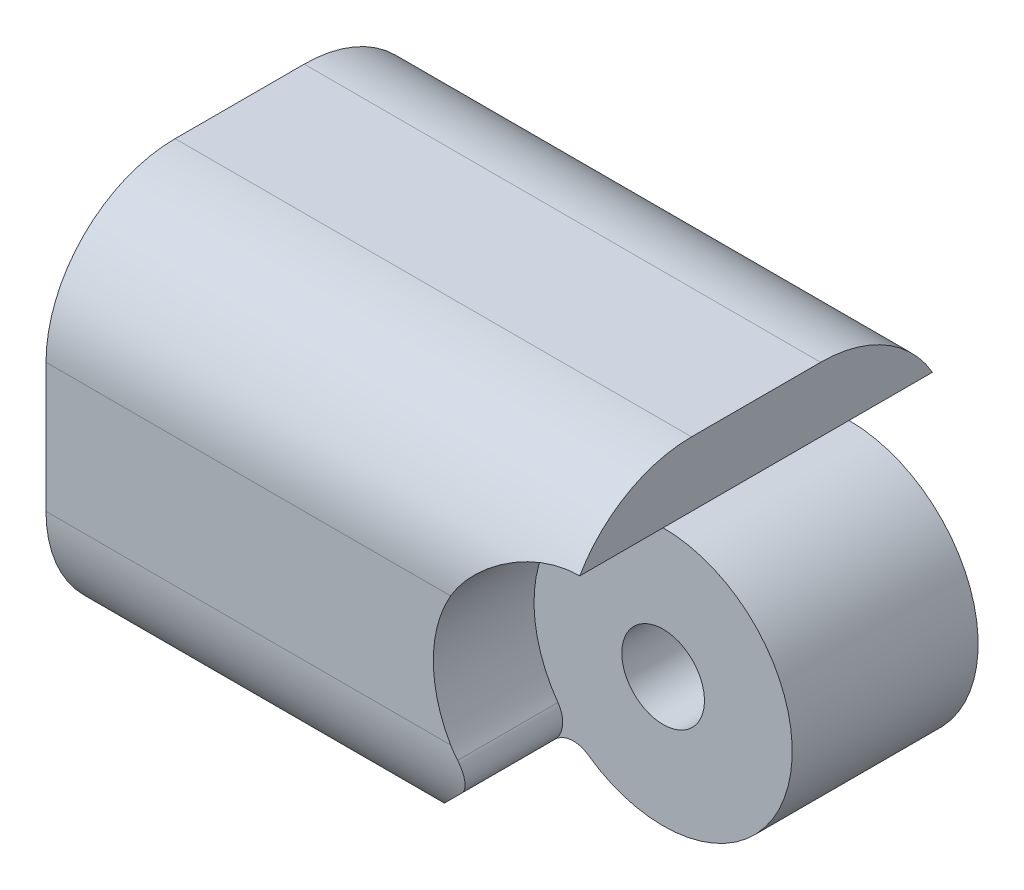
ISO-10303-21;
HEADER;
FILE_DESCRIPTION(('STEP AP214'),'2;1');
FILE_NAME('part.step','',(''),(''),'','','');
FILE_SCHEMA(('AUTOMOTIVE_DESIGN { 1 0 10303 214 1 1 1 1 }'));
ENDSEC;
DATA;
#1=APPLICATION_CONTEXT('core data for automotive mechanical design processes');
#2=APPLICATION_PROTOCOL_DEFINITION('international standard','automotive_design',2000,#1);
#3=PRODUCT_CONTEXT('',#1,'mechanical');
#4=PRODUCT('Part','Part','',(#3));
#5=PRODUCT_RELATED_PRODUCT_CATEGORY('part','',(#4));
#6=PRODUCT_DEFINITION_FORMATION('','',#4);
#7=PRODUCT_DEFINITION_CONTEXT('part definition',#1,'design');
#8=PRODUCT_DEFINITION('design','',#6,#7);
#9=PRODUCT_DEFINITION_SHAPE('','',#8);
#10=(LENGTH_UNIT() NAMED_UNIT(*) SI_UNIT(.MILLI.,.METRE.));
#11=(NAMED_UNIT(*) PLANE_ANGLE_UNIT() SI_UNIT($,.RADIAN.));
#12=(NAMED_UNIT(*) SI_UNIT($,.STERADIAN.) SOLID_ANGLE_UNIT());
#13=UNCERTAINTY_MEASURE_WITH_UNIT(LENGTH_MEASURE(1.E-05),#10,'distance_accuracy_value','');
#14=(GEOMETRIC_REPRESENTATION_CONTEXT(3) GLOBAL_UNCERTAINTY_ASSIGNED_CONTEXT((#13)) GLOBAL_UNIT_ASSIGNED_CONTEXT((#10,
#11,#12)) REPRESENTATION_CONTEXT('',''));
#15=CARTESIAN_POINT('',(0.,0.,0.));
#16=DIRECTION('',(0.,0.,1.));
#17=DIRECTION('',(1.,0.,0.));
#18=AXIS2_PLACEMENT_3D('',#15,#16,#17);
#19=CARTESIAN_POINT('',(10.,0.,7.5));
#20=DIRECTION('',(0.,0.,-1.));
#21=DIRECTION('',(-1.,0.,0.));
#22=AXIS2_PLACEMENT_3D('',#19,#20,#21);
#23=CYLINDRICAL_SURFACE('',#22,5.);
#24=CARTESIAN_POINT('',(10.,0.,11.1));
#25=DIRECTION('',(0.,0.,-1.));
#26=DIRECTION('',(-1.,0.,0.));
#27=AXIS2_PLACEMENT_3D('',#24,#25,#26);
#28=CIRCLE('',#27,5.);
#29=CARTESIAN_POINT('',(10.,5.,11.1));
#30=VERTEX_POINT('',#29);
#31=CARTESIAN_POINT('',(7.10317220709676,-4.07533909488074,11.1));
#32=VERTEX_POINT('',#31);
#33=EDGE_CURVE('E328',#30,#32,#28,.T.);
#34=ORIENTED_EDGE('',*,*,#33,.T.);
#35=DIRECTION('',(0.,0.,-1.));
#36=VECTOR('',#35,1.);
#37=CARTESIAN_POINT('',(7.10317220709676,-4.07533909488073,7.5));
#38=LINE('',#37,#36);
#39=CARTESIAN_POINT('',(7.10317220709676,-4.07533909488074,3.9));
#40=VERTEX_POINT('',#39);
#41=EDGE_CURVE('E315',#32,#40,#38,.T.);
#42=ORIENTED_EDGE('',*,*,#41,.T.);
#43=CARTESIAN_POINT('',(10.,0.,3.9));
#44=DIRECTION('',(0.,0.,-1.));
#45=DIRECTION('',(-1.,0.,0.));
#46=AXIS2_PLACEMENT_3D('',#43,#44,#45);
#47=CIRCLE('',#46,5.);
#48=CARTESIAN_POINT('',(10.,5.,3.9));
#49=VERTEX_POINT('',#48);
#50=EDGE_CURVE('E257',#49,#40,#47,.T.);
#51=ORIENTED_EDGE('',*,*,#50,.F.);
#52=DIRECTION('',(0.,0.,-1.));
#53=VECTOR('',#52,1.);
#54=CARTESIAN_POINT('',(10.,5.,7.5));
#55=LINE('',#54,#53);
#56=EDGE_CURVE('E330',#30,#49,#55,.T.);
#57=ORIENTED_EDGE('',*,*,#56,.F.);
#58=EDGE_LOOP('',(#34,#42,#51,#57));
#59=FACE_BOUND('',#58,.T.);
#60=ADVANCED_FACE('F33',(#59),#23,.T.);
#61=CARTESIAN_POINT('',(10.,0.,7.5));
#62=DIRECTION('',(0.,0.,-1.));
#63=DIRECTION('',(-1.,0.,0.));
#64=AXIS2_PLACEMENT_3D('',#61,#62,#63);
#65=CYLINDRICAL_SURFACE('',#64,1.6);
#66=CARTESIAN_POINT('',(10.,0.,3.9));
#67=DIRECTION('',(0.,0.,-1.));
#68=DIRECTION('',(-1.,0.,0.));
#69=AXIS2_PLACEMENT_3D('',#66,#67,#68);
#70=CIRCLE('',#69,1.6);
#71=CARTESIAN_POINT('',(8.4,0.,3.9));
#72=VERTEX_POINT('',#71);
#73=EDGE_CURVE('E294',#72,#72,#70,.T.);
#74=ORIENTED_EDGE('',*,*,#73,.T.);
#75=EDGE_LOOP('',(#74));
#76=FACE_BOUND('',#75,.T.);
#77=CARTESIAN_POINT('',(10.,0.,11.1));
#78=DIRECTION('',(0.,0.,-1.));
#79=DIRECTION('',(-1.,0.,0.));
#80=AXIS2_PLACEMENT_3D('',#77,#78,#79);
#81=CIRCLE('',#80,1.6);
#82=CARTESIAN_POINT('',(8.4,0.,11.1));
#83=VERTEX_POINT('',#82);
#84=EDGE_CURVE('E223',#83,#83,#81,.T.);
#85=ORIENTED_EDGE('',*,*,#84,.F.);
#86=EDGE_LOOP('',(#85));
#87=FACE_BOUND('',#86,.T.);
#88=ADVANCED_FACE('F441',(#76,#87),#65,.F.);
#89=CARTESIAN_POINT('',(10.,0.,0.));
#90=DIRECTION('',(0.,0.,1.));
#91=DIRECTION('',(1.,0.,0.));
#92=AXIS2_PLACEMENT_3D('',#89,#90,#91);
#93=PLANE('',#92);
#94=DIRECTION('',(-1.,0.,0.));
#95=VECTOR('',#94,1.);
#96=CARTESIAN_POINT('',(10.,2.5,0.));
#97=LINE('',#96,#95);
#98=CARTESIAN_POINT('',(-10.,2.5,0.));
#99=VERTEX_POINT('',#98);
#100=CARTESIAN_POINT('',(5.6698729810778,2.5,0.));
#101=VERTEX_POINT('',#100);
#102=EDGE_CURVE('E388',#99,#101,#97,.F.);
#103=ORIENTED_EDGE('',*,*,#102,.T.);
#104=CARTESIAN_POINT('',(10.,0.,0.));
#105=DIRECTION('',(0.,0.,-1.));
#106=DIRECTION('',(-1.,0.,0.));
#107=AXIS2_PLACEMENT_3D('',#104,#105,#106);
#108=CIRCLE('',#107,5.);
#109=CARTESIAN_POINT('',(5.6698729810778,-2.5,0.));
#110=VERTEX_POINT('',#109);
#111=EDGE_CURVE('E254',#110,#101,#108,.T.);
#112=ORIENTED_EDGE('',*,*,#111,.F.);
#113=DIRECTION('',(1.,0.,0.));
#114=VECTOR('',#113,1.);
#115=CARTESIAN_POINT('',(10.,-2.5,0.));
#116=LINE('',#115,#114);
#117=CARTESIAN_POINT('',(-10.,-2.5,0.));
#118=VERTEX_POINT('',#117);
#119=EDGE_CURVE('E391',#110,#118,#116,.F.);
#120=ORIENTED_EDGE('',*,*,#119,.T.);
#121=DIRECTION('',(0.,-1.,0.));
#122=VECTOR('',#121,1.);
#123=CARTESIAN_POINT('',(-10.,7.5,0.));
#124=LINE('',#123,#122);
#125=EDGE_CURVE('E417',#99,#118,#124,.T.);
#126=ORIENTED_EDGE('',*,*,#125,.F.);
#127=EDGE_LOOP('',(#103,#112,#120,#126));
#128=FACE_BOUND('',#127,.T.);
#129=ADVANCED_FACE('F421',(#128),#93,.F.);
#130=CARTESIAN_POINT('',(10.,5.,7.5));
#131=DIRECTION('',(-1.,0.,0.));
#132=DIRECTION('',(0.,0.,1.));
#133=AXIS2_PLACEMENT_3D('',#130,#131,#132);
#134=PLANE('',#133);
#135=ORIENTED_EDGE('',*,*,#56,.T.);
#136=DIRECTION('',(0.,0.,-1.));
#137=VECTOR('',#136,1.);
#138=CARTESIAN_POINT('',(10.,5.,3.9));
#139=LINE('',#138,#137);
#140=CARTESIAN_POINT('',(10.,5.,0.669872981077808));
#141=VERTEX_POINT('',#140);
#142=EDGE_CURVE('E267',#49,#141,#139,.T.);
#143=ORIENTED_EDGE('',*,*,#142,.T.);
#144=CARTESIAN_POINT('',(10.,2.5,5.));
#145=DIRECTION('',(-1.,0.,0.));
#146=DIRECTION('',(0.,0.,1.));
#147=AXIS2_PLACEMENT_3D('',#144,#145,#146);
#148=CIRCLE('',#147,5.);
#149=CARTESIAN_POINT('',(10.,7.5,5.));
#150=VERTEX_POINT('',#149);
#151=EDGE_CURVE('E292',#141,#150,#148,.F.);
#152=ORIENTED_EDGE('',*,*,#151,.T.);
#153=DIRECTION('',(0.,0.,-1.));
#154=VECTOR('',#153,1.);
#155=CARTESIAN_POINT('',(10.,7.5,7.5));
#156=LINE('',#155,#154);
#157=CARTESIAN_POINT('',(10.,7.5,10.));
#158=VERTEX_POINT('',#157);
#159=EDGE_CURVE('E407',#158,#150,#156,.T.);
#160=ORIENTED_EDGE('',*,*,#159,.F.);
#161=CARTESIAN_POINT('',(10.,2.5,10.));
#162=DIRECTION('',(1.,0.,0.));
#163=DIRECTION('',(0.,0.,-1.));
#164=AXIS2_PLACEMENT_3D('',#161,#162,#163);
#165=CIRCLE('',#164,5.);
#166=CARTESIAN_POINT('',(10.,5.,14.3301270189222));
#167=VERTEX_POINT('',#166);
#168=EDGE_CURVE('E211',#167,#158,#165,.F.);
#169=ORIENTED_EDGE('',*,*,#168,.F.);
#170=DIRECTION('',(0.,0.,1.));
#171=VECTOR('',#170,1.);
#172=CARTESIAN_POINT('',(10.,5.,11.1));
#173=LINE('',#172,#171);
#174=EDGE_CURVE('E336',#30,#167,#173,.T.);
#175=ORIENTED_EDGE('',*,*,#174,.F.);
#176=EDGE_LOOP('',(#135,#143,#152,#160,#169,#175));
#177=FACE_BOUND('',#176,.T.);
#178=ADVANCED_FACE('F405',(#177),#134,.F.);
#179=CARTESIAN_POINT('',(-10.,7.5,7.5));
#180=DIRECTION('',(0.,-1.,0.));
#181=DIRECTION('',(0.,0.,-1.));
#182=AXIS2_PLACEMENT_3D('',#179,#180,#181);
#183=PLANE('',#182);
#184=ORIENTED_EDGE('',*,*,#159,.T.);
#185=DIRECTION('',(-1.,0.,0.));
#186=VECTOR('',#185,1.);
#187=CARTESIAN_POINT('',(-10.,7.5,5.));
#188=LINE('',#187,#186);
#189=CARTESIAN_POINT('',(-10.,7.5,5.));
#190=VERTEX_POINT('',#189);
#191=EDGE_CURVE('E396',#150,#190,#188,.T.);
#192=ORIENTED_EDGE('',*,*,#191,.T.);
#193=DIRECTION('',(0.,0.,-1.));
#194=VECTOR('',#193,1.);
#195=CARTESIAN_POINT('',(-10.,7.5,7.5));
#196=LINE('',#195,#194);
#197=CARTESIAN_POINT('',(-10.,7.5,10.));
#198=VERTEX_POINT('',#197);
#199=EDGE_CURVE('E411',#198,#190,#196,.T.);
#200=ORIENTED_EDGE('',*,*,#199,.F.);
#201=DIRECTION('',(-1.,0.,0.));
#202=VECTOR('',#201,1.);
#203=CARTESIAN_POINT('',(-10.,7.5,10.));
#204=LINE('',#203,#202);
#205=EDGE_CURVE('E208',#158,#198,#204,.T.);
#206=ORIENTED_EDGE('',*,*,#205,.F.);
#207=EDGE_LOOP('',(#184,#192,#200,#206));
#208=FACE_BOUND('',#207,.T.);
#209=ADVANCED_FACE('F410',(#208),#183,.F.);
#210=CARTESIAN_POINT('',(-10.,7.5,7.5));
#211=DIRECTION('',(1.,0.,0.));
#212=DIRECTION('',(0.,0.,-1.));
#213=AXIS2_PLACEMENT_3D('',#210,#211,#212);
#214=PLANE('',#213);
#215=DIRECTION('',(0.,0.,1.));
#216=VECTOR('',#215,1.);
#217=CARTESIAN_POINT('',(-10.,-1.6,3.75));
#218=LINE('',#217,#216);
#219=CARTESIAN_POINT('',(-10.,-1.6,11.25));
#220=VERTEX_POINT('',#219);
#221=CARTESIAN_POINT('',(-10.,-1.6,3.75));
#222=VERTEX_POINT('',#221);
#223=EDGE_CURVE('E366',#220,#222,#218,.F.);
#224=ORIENTED_EDGE('',*,*,#223,.F.);
#225=DIRECTION('',(0.,-1.,0.));
#226=VECTOR('',#225,1.);
#227=CARTESIAN_POINT('',(-10.,7.5,11.25));
#228=LINE('',#227,#226);
#229=CARTESIAN_POINT('',(-10.,-5.075,11.25));
#230=VERTEX_POINT('',#229);
#231=EDGE_CURVE('E200',#220,#230,#228,.T.);
#232=ORIENTED_EDGE('',*,*,#231,.T.);
#233=DIRECTION('',(0.,0.,1.));
#234=VECTOR('',#233,1.);
#235=CARTESIAN_POINT('',(-10.,-5.075,3.75));
#236=LINE('',#235,#234);
#237=CARTESIAN_POINT('',(-10.,-5.075,3.75));
#238=VERTEX_POINT('',#237);
#239=EDGE_CURVE('E365',#230,#238,#236,.F.);
#240=ORIENTED_EDGE('',*,*,#239,.T.);
#241=DIRECTION('',(0.,-1.,0.));
#242=VECTOR('',#241,1.);
#243=CARTESIAN_POINT('',(-10.,7.5,3.75));
#244=LINE('',#243,#242);
#245=EDGE_CURVE('E379',#222,#238,#244,.T.);
#246=ORIENTED_EDGE('',*,*,#245,.F.);
#247=EDGE_LOOP('',(#224,#232,#240,#246));
#248=FACE_BOUND('',#247,.T.);
#249=DIRECTION('',(0.,0.,1.));
#250=VECTOR('',#249,1.);
#251=CARTESIAN_POINT('',(-10.,5.075,3.75));
#252=LINE('',#251,#250);
#253=CARTESIAN_POINT('',(-10.,5.075,3.75));
#254=VERTEX_POINT('',#253);
#255=CARTESIAN_POINT('',(-10.,5.075,11.25));
#256=VERTEX_POINT('',#255);
#257=EDGE_CURVE('E375',#254,#256,#252,.T.);
#258=ORIENTED_EDGE('',*,*,#257,.T.);
#259=CARTESIAN_POINT('',(-10.,1.6,11.25));
#260=VERTEX_POINT('',#259);
#261=EDGE_CURVE('E194',#256,#260,#228,.T.);
#262=ORIENTED_EDGE('',*,*,#261,.T.);
#263=DIRECTION('',(0.,0.,1.));
#264=VECTOR('',#263,1.);
#265=CARTESIAN_POINT('',(-10.,1.6,3.75));
#266=LINE('',#265,#264);
#267=CARTESIAN_POINT('',(-10.,1.6,3.75));
#268=VERTEX_POINT('',#267);
#269=EDGE_CURVE('E378',#268,#260,#266,.T.);
#270=ORIENTED_EDGE('',*,*,#269,.F.);
#271=EDGE_CURVE('E381',#254,#268,#244,.T.);
#272=ORIENTED_EDGE('',*,*,#271,.F.);
#273=EDGE_LOOP('',(#258,#262,#270,#272));
#274=FACE_BOUND('',#273,.T.);
#275=ORIENTED_EDGE('',*,*,#125,.T.);
#276=CARTESIAN_POINT('',(-10.,-2.5,5.));
#277=DIRECTION('',(1.,0.,0.));
#278=DIRECTION('',(0.,0.,-1.));
#279=AXIS2_PLACEMENT_3D('',#276,#277,#278);
#280=CIRCLE('',#279,5.);
#281=CARTESIAN_POINT('',(-10.,-7.5,5.));
#282=VERTEX_POINT('',#281);
#283=EDGE_CURVE('E395',#118,#282,#280,.F.);
#284=ORIENTED_EDGE('',*,*,#283,.T.);
#285=DIRECTION('',(0.,0.,-1.));
#286=VECTOR('',#285,1.);
#287=CARTESIAN_POINT('',(-10.,-7.5,7.5));
#288=LINE('',#287,#286);
#289=CARTESIAN_POINT('',(-10.,-7.5,10.));
#290=VERTEX_POINT('',#289);
#291=EDGE_CURVE('E424',#290,#282,#288,.T.);
#292=ORIENTED_EDGE('',*,*,#291,.F.);
#293=CARTESIAN_POINT('',(-10.,-2.5,10.));
#294=DIRECTION('',(-1.,0.,0.));
#295=DIRECTION('',(0.,0.,1.));
#296=AXIS2_PLACEMENT_3D('',#293,#294,#295);
#297=CIRCLE('',#296,5.);
#298=CARTESIAN_POINT('',(-10.,-2.5,15.));
#299=VERTEX_POINT('',#298);
#300=EDGE_CURVE('E192',#299,#290,#297,.F.);
#301=ORIENTED_EDGE('',*,*,#300,.F.);
#302=DIRECTION('',(0.,-1.,0.));
#303=VECTOR('',#302,1.);
#304=CARTESIAN_POINT('',(-10.,7.5,15.));
#305=LINE('',#304,#303);
#306=CARTESIAN_POINT('',(-10.,2.5,15.));
#307=VERTEX_POINT('',#306);
#308=EDGE_CURVE('E352',#307,#299,#305,.T.);
#309=ORIENTED_EDGE('',*,*,#308,.F.);
#310=CARTESIAN_POINT('',(-10.,2.5,10.));
#311=DIRECTION('',(-1.,0.,0.));
#312=DIRECTION('',(0.,0.,1.));
#313=AXIS2_PLACEMENT_3D('',#310,#311,#312);
#314=CIRCLE('',#313,5.);
#315=EDGE_CURVE('E205',#198,#307,#314,.F.);
#316=ORIENTED_EDGE('',*,*,#315,.F.);
#317=ORIENTED_EDGE('',*,*,#199,.T.);
#318=CARTESIAN_POINT('',(-10.,2.5,5.));
#319=DIRECTION('',(1.,0.,0.));
#320=DIRECTION('',(0.,0.,-1.));
#321=AXIS2_PLACEMENT_3D('',#318,#319,#320);
#322=CIRCLE('',#321,5.);
#323=EDGE_CURVE('E393',#190,#99,#322,.F.);
#324=ORIENTED_EDGE('',*,*,#323,.T.);
#325=EDGE_LOOP('',(#275,#284,#292,#301,#309,#316,#317,#324));
#326=FACE_BOUND('',#325,.T.);
#327=ADVANCED_FACE('F362',(#248,#274,#326),#214,.F.);
#328=CARTESIAN_POINT('',(-10.,-7.5,7.5));
#329=DIRECTION('',(0.,1.,0.));
#330=DIRECTION('',(0.,0.,1.));
#331=AXIS2_PLACEMENT_3D('',#328,#329,#330);
#332=PLANE('',#331);
#333=DIRECTION('',(1.,0.,0.));
#334=VECTOR('',#333,1.);
#335=CARTESIAN_POINT('',(-10.,-7.5,5.));
#336=LINE('',#335,#334);
#337=CARTESIAN_POINT('',(2.49999999999981,-7.5,5.));
#338=VERTEX_POINT('',#337);
#339=EDGE_CURVE('E172',#282,#338,#336,.T.);
#340=ORIENTED_EDGE('',*,*,#339,.T.);
#341=DIRECTION('',(0.,0.,-1.));
#342=VECTOR('',#341,1.);
#343=CARTESIAN_POINT('',(2.49999999999981,-7.5,7.5));
#344=LINE('',#343,#342);
#345=CARTESIAN_POINT('',(2.49999999999981,-7.5,10.));
#346=VERTEX_POINT('',#345);
#347=EDGE_CURVE('E164',#346,#338,#344,.T.);
#348=ORIENTED_EDGE('',*,*,#347,.F.);
#349=DIRECTION('',(1.,0.,0.));
#350=VECTOR('',#349,1.);
#351=CARTESIAN_POINT('',(-10.,-7.5,10.));
#352=LINE('',#351,#350);
#353=EDGE_CURVE('E169',#290,#346,#352,.T.);
#354=ORIENTED_EDGE('',*,*,#353,.F.);
#355=ORIENTED_EDGE('',*,*,#291,.T.);
#356=EDGE_LOOP('',(#340,#348,#354,#355));
#357=FACE_BOUND('',#356,.T.);
#358=ADVANCED_FACE('F166',(#357),#332,.F.);
#359=CARTESIAN_POINT('',(-10.,0.,3.75));
#360=DIRECTION('',(0.,0.,1.));
#361=DIRECTION('',(1.,0.,0.));
#362=AXIS2_PLACEMENT_3D('',#359,#360,#361);
#363=CYLINDRICAL_SURFACE('',#362,5.075);
#364=CARTESIAN_POINT('',(-10.,0.,3.75));
#365=DIRECTION('',(0.,0.,1.));
#366=DIRECTION('',(1.,0.,0.));
#367=AXIS2_PLACEMENT_3D('',#364,#365,#366);
#368=CIRCLE('',#367,5.075);
#369=EDGE_CURVE('E377',#238,#254,#368,.T.);
#370=ORIENTED_EDGE('',*,*,#369,.F.);
#371=ORIENTED_EDGE('',*,*,#239,.F.);
#372=CARTESIAN_POINT('',(-10.,0.,11.25));
#373=DIRECTION('',(0.,0.,1.));
#374=DIRECTION('',(1.,0.,0.));
#375=AXIS2_PLACEMENT_3D('',#372,#373,#374);
#376=CIRCLE('',#375,5.075);
#377=EDGE_CURVE('E350',#230,#256,#376,.T.);
#378=ORIENTED_EDGE('',*,*,#377,.T.);
#379=ORIENTED_EDGE('',*,*,#257,.F.);
#380=EDGE_LOOP('',(#370,#371,#378,#379));
#381=FACE_BOUND('',#380,.T.);
#382=ADVANCED_FACE('F374',(#381),#363,.F.);
#383=CARTESIAN_POINT('',(-10.,0.,3.75));
#384=DIRECTION('',(0.,0.,1.));
#385=DIRECTION('',(1.,0.,0.));
#386=AXIS2_PLACEMENT_3D('',#383,#384,#385);
#387=PLANE('',#386);
#388=ORIENTED_EDGE('',*,*,#271,.T.);
#389=CARTESIAN_POINT('',(-10.,0.,3.75));
#390=DIRECTION('',(0.,0.,1.));
#391=DIRECTION('',(1.,0.,0.));
#392=AXIS2_PLACEMENT_3D('',#389,#390,#391);
#393=CIRCLE('',#392,1.6);
#394=EDGE_CURVE('E427',#222,#268,#393,.T.);
#395=ORIENTED_EDGE('',*,*,#394,.F.);
#396=ORIENTED_EDGE('',*,*,#245,.T.);
#397=ORIENTED_EDGE('',*,*,#369,.T.);
#398=EDGE_LOOP('',(#388,#395,#396,#397));
#399=FACE_BOUND('',#398,.T.);
#400=ADVANCED_FACE('F436',(#399),#387,.T.);
#401=CARTESIAN_POINT('',(-10.,0.,3.75));
#402=DIRECTION('',(0.,0.,1.));
#403=DIRECTION('',(1.,0.,0.));
#404=AXIS2_PLACEMENT_3D('',#401,#402,#403);
#405=CYLINDRICAL_SURFACE('',#404,1.6);
#406=ORIENTED_EDGE('',*,*,#269,.T.);
#407=CARTESIAN_POINT('',(-10.,0.,11.25));
#408=DIRECTION('',(0.,0.,1.));
#409=DIRECTION('',(1.,0.,0.));
#410=AXIS2_PLACEMENT_3D('',#407,#408,#409);
#411=CIRCLE('',#410,1.6);
#412=EDGE_CURVE('E347',#220,#260,#411,.T.);
#413=ORIENTED_EDGE('',*,*,#412,.F.);
#414=ORIENTED_EDGE('',*,*,#223,.T.);
#415=ORIENTED_EDGE('',*,*,#394,.T.);
#416=EDGE_LOOP('',(#406,#413,#414,#415));
#417=FACE_BOUND('',#416,.T.);
#418=ADVANCED_FACE('F280',(#417),#405,.T.);
#419=CARTESIAN_POINT('',(-10.,-2.5,5.));
#420=DIRECTION('',(1.,0.,0.));
#421=DIRECTION('',(0.,0.,-1.));
#422=AXIS2_PLACEMENT_3D('',#419,#420,#421);
#423=CYLINDRICAL_SURFACE('',#422,5.);
#424=CARTESIAN_POINT('',(14.3301270189222,-2.5,0.));
#425=CARTESIAN_POINT('',(14.2632927825264,-2.61580957497628,-1.41932239408108E-05));
#426=CARTESIAN_POINT('',(14.1918137530019,-2.72884062002865,0.00402213695113356));
#427=CARTESIAN_POINT('',(14.0403788717469,-2.94839504452801,0.0189366187205118));
#428=CARTESIAN_POINT('',(13.9604341104207,-3.05492665685752,0.0298059088871243));
#429=CARTESIAN_POINT('',(13.793203951597,-3.26022157723136,0.057052038972317));
#430=CARTESIAN_POINT('',(13.7059651727145,-3.35902742264858,0.0733956483218822));
#431=CARTESIAN_POINT('',(13.5244215070913,-3.54904817579328,0.110329726396959));
#432=CARTESIAN_POINT('',(13.4301143561326,-3.64026063120375,0.130921559693788));
#433=CARTESIAN_POINT('',(13.1383705900926,-3.90107144189425,0.196978225106134));
#434=CARTESIAN_POINT('',(12.9311978392689,-4.05895816423618,0.246898277728611));
#435=CARTESIAN_POINT('',(12.6043647564168,-4.2701555149806,0.323227987055815));
#436=CARTESIAN_POINT('',(12.4925637041479,-4.33636153197791,0.348952038255138));
#437=CARTESIAN_POINT('',(12.2639708280311,-4.45996606763562,0.399675265949311));
#438=CARTESIAN_POINT('',(12.1471785152509,-4.51736372090881,0.424674371025613));
#439=CARTESIAN_POINT('',(11.8974993790772,-4.62816763997649,0.475072713785704));
#440=CARTESIAN_POINT('',(11.7641550278364,-4.68063586802702,0.500272361161181));
#441=CARTESIAN_POINT('',(11.4928889854497,-4.77408064309314,0.546767189332914));
#442=CARTESIAN_POINT('',(11.3549693478613,-4.81506226971743,0.568064094554076));
#443=CARTESIAN_POINT('',(11.0756400115218,-4.88504794634276,0.605330445535259));
#444=CARTESIAN_POINT('',(10.934236210347,-4.91407093619305,0.621308307719137));
#445=CARTESIAN_POINT('',(10.6488841820357,-4.95982038517945,0.646842896091123));
#446=CARTESIAN_POINT('',(10.5049363647335,-4.97654880677653,0.656400647037461));
#447=CARTESIAN_POINT('',(10.2284415233662,-4.99653074314546,0.667858367537892));
#448=CARTESIAN_POINT('',(10.095994067421,-5.00083142279019,0.670353053011175));
#449=CARTESIAN_POINT('',(9.83120648478422,-4.99890358572035,0.669239921224167));
#450=CARTESIAN_POINT('',(9.69886635331676,-4.99267556652821,0.665632392317501));
#451=CARTESIAN_POINT('',(9.43534436918494,-4.96977437944419,0.652542308032285));
#452=CARTESIAN_POINT('',(9.30416290041501,-4.95309787231639,0.643057874462398));
#453=CARTESIAN_POINT('',(9.04403811539105,-4.9095366700614,0.618819597663815));
#454=CARTESIAN_POINT('',(8.91509483011041,-4.88265183378245,0.604065681573543));
#455=CARTESIAN_POINT('',(8.54950425101977,-4.7912653600638,0.555372032925043));
#456=CARTESIAN_POINT('',(8.31657446606787,-4.71437236071282,0.515898045904105));
#457=CARTESIAN_POINT('',(7.86570355239189,-4.52819218550339,0.428681149613872));
#458=CARTESIAN_POINT('',(7.64778009511158,-4.41886759567397,0.380928716691755));
#459=CARTESIAN_POINT('',(7.20158065476628,-4.15271129012548,0.278614127046545));
#460=CARTESIAN_POINT('',(6.97591196334193,-3.99144631377934,0.224007124153939));
#461=CARTESIAN_POINT('',(6.65906351452559,-3.72254407978077,0.150875181847771));
#462=CARTESIAN_POINT('',(6.55711866030323,-3.62848258175482,0.127973602075449));
#463=CARTESIAN_POINT('',(6.36098125205508,-3.4317363360125,0.0865525710214431));
#464=CARTESIAN_POINT('',(6.26678486570351,-3.32905590254195,0.0680309448498813));
#465=CARTESIAN_POINT('',(6.08236145842763,-3.11023633949458,0.0360878249925308));
#466=CARTESIAN_POINT('',(5.99257428241357,-2.99367959764812,0.0229706923196831));
#467=CARTESIAN_POINT('',(5.82324959974894,-2.75255930622084,0.00491179630343654));
#468=CARTESIAN_POINT('',(5.74372460975589,-2.62798625152613,-2.0068889527969E-05));
#469=CARTESIAN_POINT('',(5.6698729810778,-2.5,0.));
#470=B_SPLINE_CURVE_WITH_KNOTS('',3,(#424,#425,#426,#427,#428,#429,#430,#431,#432,#433,#434,
#435,#436,#437,#438,#439,#440,#441,#442,#443,#444,#445,#446,#447,#448,#449,#450,#451,#452,#453,
#454,#455,#456,#457,#458,#459,#460,#461,#462,#463,#464,#465,#466,#467,#468,#469),.UNSPECIFIED.,
.F.,.F.,(4,2,2,2,2,2,2,2,2,2,2,2,2,2,2,2,2,2,2,2,2,2,4),(0.,0.40083937060395,0.801159975962346,
1.19909328729396,1.5971546182873,2.38897065071449,2.78605757219177,3.18318348096169,
3.61911386442946,4.05485116536628,4.48989567679929,4.92487073126644,5.32194260539755,
5.71899571684537,6.11617578740865,6.51336135002667,7.25549410003319,7.99848634631314,
8.84229015368389,9.2636174338146,9.68473506020486,10.1270931180355,10.5699857148805),.UNSPECIFIED.);
#471=CARTESIAN_POINT('',(5.92466090511919,-2.89682779290314,0.0157721056537138));
#472=VERTEX_POINT('',#471);
#473=EDGE_CURVE('E259',#472,#110,#470,.T.);
#474=ORIENTED_EDGE('',*,*,#473,.F.);
#475=CARTESIAN_POINT('',(5.92466090511919,-2.89682779290314,0.0157721056537138));
#476=CARTESIAN_POINT('',(5.94081590144125,-2.91955471658053,0.0175810962645307));
#477=CARTESIAN_POINT('',(5.95600372200508,-2.94293605763679,0.0195997685953495));
#478=CARTESIAN_POINT('',(5.98435938246824,-2.9908486779241,0.0240933825655073));
#479=CARTESIAN_POINT('',(5.99752738900934,-3.01537986207079,0.0265682865269953));
#480=CARTESIAN_POINT('',(6.03381753492661,-3.09034277329388,0.0347198254986539));
#481=CARTESIAN_POINT('',(6.05380593054644,-3.14225700976558,0.0411318123005678));
#482=CARTESIAN_POINT('',(6.08487132470588,-3.24838777192696,0.0560349015441719));
#483=CARTESIAN_POINT('',(6.09594519927068,-3.30260509770252,0.0645267314806282));
#484=CARTESIAN_POINT('',(6.10902781545447,-3.41176770256589,0.0835229081231492));
#485=CARTESIAN_POINT('',(6.11103760067529,-3.46671289711925,0.0940270229978499));
#486=CARTESIAN_POINT('',(6.10608570946658,-3.57649049918018,0.116932146850645));
#487=CARTESIAN_POINT('',(6.09901405651577,-3.63131331626615,0.129354775519702));
#488=CARTESIAN_POINT('',(6.07606550322852,-3.73878268733625,0.15557214501252));
#489=CARTESIAN_POINT('',(6.06018118961708,-3.79142736893776,0.169368033003685));
#490=CARTESIAN_POINT('',(6.01935162468264,-3.89520384931793,0.198289724515845));
#491=CARTESIAN_POINT('',(5.9940793612374,-3.94619815163404,0.213446338606426));
#492=CARTESIAN_POINT('',(5.93532367923507,-4.04308695180037,0.243798577277156));
#493=CARTESIAN_POINT('',(5.90185640300599,-4.08899122069671,0.258994067746455));
#494=CARTESIAN_POINT('',(5.84932840467468,-4.14950294614159,0.279883548089836));
#495=CARTESIAN_POINT('',(5.83331381144695,-4.1666907633323,0.285928738861353));
#496=CARTESIAN_POINT('',(5.81669986732957,-4.18330013267033,0.291868665452072));
#497=B_SPLINE_CURVE_WITH_KNOTS('',3,(#475,#476,#477,#478,#479,#480,#481,#482,#483,#484,#485,
#486,#487,#488,#489,#490,#491,#492,#493,#494,#495,#496),.UNSPECIFIED.,.F.,.F.,(4,2,2,2,2,2,2,2,
2,2,4),(0.,0.0837750924706517,0.167543269479265,0.334668257973649,0.501851787723164,
0.669016068159817,0.838223932646716,1.00757435232671,1.18348173883688,1.3590453760971,
1.43175815198204),.UNSPECIFIED.);
#498=CARTESIAN_POINT('',(5.81669986732957,-4.18330013267033,0.291868665452073));
#499=VERTEX_POINT('',#498);
#500=EDGE_CURVE('E305',#472,#499,#497,.T.);
#501=ORIENTED_EDGE('',*,*,#500,.T.);
#502=CARTESIAN_POINT('',(7.49999999999994,-2.5,5.));
#503=DIRECTION('',(-0.707106781186539,0.707106781186556,0.));
#504=DIRECTION('',(0.707106781186556,0.707106781186539,0.));
#505=AXIS2_PLACEMENT_3D('',#502,#503,#504);
#506=ELLIPSE('',#505,7.07106781186556,5.);
#507=EDGE_CURVE('E176',#338,#499,#506,.F.);
#508=ORIENTED_EDGE('',*,*,#507,.F.);
#509=ORIENTED_EDGE('',*,*,#339,.F.);
#510=ORIENTED_EDGE('',*,*,#283,.F.);
#511=ORIENTED_EDGE('',*,*,#119,.F.);
#512=EDGE_LOOP('',(#474,#501,#508,#509,#510,#511));
#513=FACE_BOUND('',#512,.T.);
#514=ADVANCED_FACE('F269',(#513),#423,.T.);
#515=CARTESIAN_POINT('',(-10.,2.5,5.));
#516=DIRECTION('',(-1.,0.,0.));
#517=DIRECTION('',(0.,0.,1.));
#518=AXIS2_PLACEMENT_3D('',#515,#516,#517);
#519=CYLINDRICAL_SURFACE('',#518,5.);
#520=CARTESIAN_POINT('',(5.6698729810778,2.5,0.));
#521=CARTESIAN_POINT('',(5.73670721747356,2.61580957497628,-1.41932239406644E-05));
#522=CARTESIAN_POINT('',(5.8081862469981,2.72884062002865,0.00402213695113366));
#523=CARTESIAN_POINT('',(5.95962112825312,2.94839504452802,0.0189366187205118));
#524=CARTESIAN_POINT('',(6.03956588957932,3.05492665685752,0.0298059088871241));
#525=CARTESIAN_POINT('',(6.20679604840298,3.26022157723136,0.0570520389723167));
#526=CARTESIAN_POINT('',(6.29403482728546,3.35902742264858,0.073395648321882));
#527=CARTESIAN_POINT('',(6.47557849290869,3.54904817579328,0.110329726396959));
#528=CARTESIAN_POINT('',(6.56988564386745,3.64026063120375,0.130921559693788));
#529=CARTESIAN_POINT('',(6.86162940990736,3.90107144189425,0.196978225106135));
#530=CARTESIAN_POINT('',(7.06880216073105,4.05895816423618,0.246898277728613));
#531=CARTESIAN_POINT('',(7.39563524358319,4.27015551498061,0.323227987055816));
#532=CARTESIAN_POINT('',(7.50743629585214,4.33636153197791,0.348952038255139));
#533=CARTESIAN_POINT('',(7.73602917196885,4.45996606763562,0.399675265949312));
#534=CARTESIAN_POINT('',(7.85282148474912,4.51736372090881,0.424674371025614));
#535=CARTESIAN_POINT('',(8.10250062092276,4.6281676399765,0.475072713785705));
#536=CARTESIAN_POINT('',(8.23584497216364,4.68063586802702,0.50027236116118));
#537=CARTESIAN_POINT('',(8.50711101455026,4.77408064309314,0.546767189332914));
#538=CARTESIAN_POINT('',(8.64503065213873,4.81506226971744,0.568064094554075));
#539=CARTESIAN_POINT('',(8.92435998847815,4.88504794634276,0.60533044553526));
#540=CARTESIAN_POINT('',(9.06576378965299,4.91407093619306,0.621308307719138));
#541=CARTESIAN_POINT('',(9.35111581796428,4.95982038517945,0.646842896091124));
#542=CARTESIAN_POINT('',(9.49506363526647,4.97654880677653,0.65640064703746));
#543=CARTESIAN_POINT('',(9.77155847663378,4.99653074314546,0.667858367537892));
#544=CARTESIAN_POINT('',(9.90400593257898,5.00083142279019,0.670353053011176));
#545=CARTESIAN_POINT('',(10.1687935152158,4.99890358572035,0.669239921224167));
#546=CARTESIAN_POINT('',(10.3011336466832,4.99267556652821,0.6656323923175));
#547=CARTESIAN_POINT('',(10.5646556308151,4.96977437944419,0.652542308032284));
#548=CARTESIAN_POINT('',(10.695837099585,4.95309787231639,0.643057874462398));
#549=CARTESIAN_POINT('',(10.955961884609,4.9095366700614,0.618819597663815));
#550=CARTESIAN_POINT('',(11.0849051698896,4.88265183378245,0.604065681573542));
#551=CARTESIAN_POINT('',(11.4504957489802,4.7912653600638,0.555372032925041));
#552=CARTESIAN_POINT('',(11.6834255339321,4.71437236071282,0.515898045904104));
#553=CARTESIAN_POINT('',(12.1342964476081,4.52819218550339,0.428681149613871));
#554=CARTESIAN_POINT('',(12.3522199048884,4.41886759567397,0.380928716691754));
#555=CARTESIAN_POINT('',(12.7984193452337,4.15271129012548,0.278614127046544));
#556=CARTESIAN_POINT('',(13.0240880366581,3.99144631377934,0.224007124153938));
#557=CARTESIAN_POINT('',(13.3409364854744,3.72254407978077,0.15087518184777));
#558=CARTESIAN_POINT('',(13.4428813396968,3.62848258175482,0.127973602075448));
#559=CARTESIAN_POINT('',(13.6390187479449,3.4317363360125,0.0865525710214423));
#560=CARTESIAN_POINT('',(13.7332151342965,3.32905590254195,0.0680309448498804));
#561=CARTESIAN_POINT('',(13.9176385415724,3.11023633949458,0.0360878249925299));
#562=CARTESIAN_POINT('',(14.0074257175864,2.99367959764812,0.0229706923196824));
#563=CARTESIAN_POINT('',(14.1767504002511,2.75255930622084,0.00491179630343627));
#564=CARTESIAN_POINT('',(14.2562753902441,2.62798625152613,-2.00688895280718E-05));
#565=CARTESIAN_POINT('',(14.3301270189222,2.5,0.));
#566=B_SPLINE_CURVE_WITH_KNOTS('',3,(#520,#521,#522,#523,#524,#525,#526,#527,#528,#529,#530,
#531,#532,#533,#534,#535,#536,#537,#538,#539,#540,#541,#542,#543,#544,#545,#546,#547,#548,#549,
#550,#551,#552,#553,#554,#555,#556,#557,#558,#559,#560,#561,#562,#563,#564,#565),.UNSPECIFIED.,
.F.,.F.,(4,2,2,2,2,2,2,2,2,2,2,2,2,2,2,2,2,2,2,2,2,2,4),(0.,0.400839370603951,0.801159975962347,
1.19909328729396,1.5971546182873,2.38897065071449,2.78605757219177,3.1831834809617,
3.61911386442946,4.05485116536628,4.4898956767993,4.92487073126644,5.32194260539755,
5.71899571684537,6.11617578740865,6.51336135002667,7.2554941000332,7.99848634631314,
8.84229015368389,9.26361743381461,9.68473506020487,10.1270931180355,10.5699857148805),.UNSPECIFIED.);
#567=EDGE_CURVE('E284',#101,#141,#566,.T.);
#568=ORIENTED_EDGE('',*,*,#567,.F.);
#569=ORIENTED_EDGE('',*,*,#102,.F.);
#570=ORIENTED_EDGE('',*,*,#323,.F.);
#571=ORIENTED_EDGE('',*,*,#191,.F.);
#572=ORIENTED_EDGE('',*,*,#151,.F.);
#573=EDGE_LOOP('',(#568,#569,#570,#571,#572));
#574=FACE_BOUND('',#573,.T.);
#575=ADVANCED_FACE('F278',(#574),#519,.T.);
#576=CARTESIAN_POINT('',(10.,0.,3.9));
#577=DIRECTION('',(0.,0.,-1.));
#578=DIRECTION('',(-1.,0.,0.));
#579=AXIS2_PLACEMENT_3D('',#576,#577,#578);
#580=CYLINDRICAL_SURFACE('',#579,5.);
#581=CARTESIAN_POINT('',(5.92466090511919,-2.89682779290314,3.9));
#582=VERTEX_POINT('',#581);
#583=EDGE_CURVE('E255',#582,#49,#47,.T.);
#584=ORIENTED_EDGE('',*,*,#583,.F.);
#585=DIRECTION('',(0.,0.,-1.));
#586=VECTOR('',#585,1.);
#587=CARTESIAN_POINT('',(5.92466090511919,-2.89682779290314,3.9));
#588=LINE('',#587,#586);
#589=EDGE_CURVE('E291',#582,#472,#588,.T.);
#590=ORIENTED_EDGE('',*,*,#589,.T.);
#591=ORIENTED_EDGE('',*,*,#473,.T.);
#592=ORIENTED_EDGE('',*,*,#111,.T.);
#593=ORIENTED_EDGE('',*,*,#567,.T.);
#594=ORIENTED_EDGE('',*,*,#142,.F.);
#595=EDGE_LOOP('',(#584,#590,#591,#592,#593,#594));
#596=FACE_BOUND('',#595,.T.);
#597=ADVANCED_FACE('F273',(#596),#580,.F.);
#598=CARTESIAN_POINT('',(10.,0.,3.9));
#599=DIRECTION('',(0.,0.,-1.));
#600=DIRECTION('',(-1.,0.,0.));
#601=AXIS2_PLACEMENT_3D('',#598,#599,#600);
#602=PLANE('',#601);
#603=ORIENTED_EDGE('',*,*,#73,.F.);
#604=EDGE_LOOP('',(#603));
#605=FACE_BOUND('',#604,.T.);
#606=ORIENTED_EDGE('',*,*,#50,.T.);
#607=CARTESIAN_POINT('',(6.52380664851611,-4.89040691385688,3.9));
#608=DIRECTION('',(0.,0.,-1.));
#609=DIRECTION('',(-1.,0.,0.));
#610=AXIS2_PLACEMENT_3D('',#607,#608,#609);
#611=CIRCLE('',#610,1.);
#612=CARTESIAN_POINT('',(5.81669986732957,-4.18330013267033,3.9));
#613=VERTEX_POINT('',#612);
#614=EDGE_CURVE('E41',#40,#613,#611,.F.);
#615=ORIENTED_EDGE('',*,*,#614,.T.);
#616=CARTESIAN_POINT('',(5.10959308614303,-3.47619335148377,3.9));
#617=DIRECTION('',(0.,0.,-1.));
#618=DIRECTION('',(-1.,0.,0.));
#619=AXIS2_PLACEMENT_3D('',#616,#617,#618);
#620=CIRCLE('',#619,1.);
#621=EDGE_CURVE('E313',#613,#582,#620,.F.);
#622=ORIENTED_EDGE('',*,*,#621,.T.);
#623=ORIENTED_EDGE('',*,*,#583,.T.);
#624=EDGE_LOOP('',(#606,#615,#622,#623));
#625=FACE_BOUND('',#624,.T.);
#626=ADVANCED_FACE('F277',(#605,#625),#602,.T.);
#627=CARTESIAN_POINT('',(6.46446609406722,-3.53553390593269,7.5));
#628=DIRECTION('',(-0.707106781186539,0.707106781186556,0.));
#629=DIRECTION('',(-0.707106781186556,-0.707106781186539,0.));
#630=AXIS2_PLACEMENT_3D('',#627,#628,#629);
#631=PLANE('',#630);
#632=DIRECTION('',(0.,0.,-1.));
#633=VECTOR('',#632,1.);
#634=CARTESIAN_POINT('',(5.81669986732957,-4.18330013267033,7.5));
#635=LINE('',#634,#633);
#636=EDGE_CURVE('E311',#499,#613,#635,.F.);
#637=ORIENTED_EDGE('',*,*,#636,.T.);
#638=DIRECTION('',(0.,0.,1.));
#639=VECTOR('',#638,1.);
#640=CARTESIAN_POINT('',(5.81669986732957,-4.18330013267033,11.1));
#641=LINE('',#640,#639);
#642=CARTESIAN_POINT('',(5.81669986732957,-4.18330013267033,11.1));
#643=VERTEX_POINT('',#642);
#644=EDGE_CURVE('E317',#613,#643,#641,.T.);
#645=ORIENTED_EDGE('',*,*,#644,.T.);
#646=DIRECTION('',(0.,0.,1.));
#647=VECTOR('',#646,1.);
#648=CARTESIAN_POINT('',(5.81669986732957,-4.18330013267033,7.5));
#649=LINE('',#648,#647);
#650=CARTESIAN_POINT('',(5.81669986732957,-4.18330013267033,14.7081313345479));
#651=VERTEX_POINT('',#650);
#652=EDGE_CURVE('E184',#651,#643,#649,.F.);
#653=ORIENTED_EDGE('',*,*,#652,.F.);
#654=CARTESIAN_POINT('',(7.49999999999994,-2.5,10.));
#655=DIRECTION('',(0.707106781186539,-0.707106781186556,0.));
#656=DIRECTION('',(0.707106781186556,0.707106781186539,0.));
#657=AXIS2_PLACEMENT_3D('',#654,#655,#656);
#658=ELLIPSE('',#657,7.07106781186556,5.);
#659=EDGE_CURVE('E180',#346,#651,#658,.F.);
#660=ORIENTED_EDGE('',*,*,#659,.F.);
#661=ORIENTED_EDGE('',*,*,#347,.T.);
#662=ORIENTED_EDGE('',*,*,#507,.T.);
#663=EDGE_LOOP('',(#637,#645,#653,#660,#661,#662));
#664=FACE_BOUND('',#663,.T.);
#665=ADVANCED_FACE('F182',(#664),#631,.F.);
#666=CARTESIAN_POINT('',(5.10959308614303,-3.47619335148377,3.9));
#667=DIRECTION('',(0.,0.,-1.));
#668=DIRECTION('',(-1.,0.,0.));
#669=AXIS2_PLACEMENT_3D('',#666,#667,#668);
#670=CYLINDRICAL_SURFACE('',#669,1.);
#671=ORIENTED_EDGE('',*,*,#621,.F.);
#672=ORIENTED_EDGE('',*,*,#636,.F.);
#673=ORIENTED_EDGE('',*,*,#500,.F.);
#674=ORIENTED_EDGE('',*,*,#589,.F.);
#675=EDGE_LOOP('',(#671,#672,#673,#674));
#676=FACE_BOUND('',#675,.T.);
#677=ADVANCED_FACE('F299',(#676),#670,.T.);
#678=CARTESIAN_POINT('',(10.,0.,15.));
#679=DIRECTION('',(0.,0.,-1.));
#680=DIRECTION('',(1.,0.,0.));
#681=AXIS2_PLACEMENT_3D('',#678,#679,#680);
#682=PLANE('',#681);
#683=DIRECTION('',(-1.,0.,0.));
#684=VECTOR('',#683,1.);
#685=CARTESIAN_POINT('',(10.,2.5,15.));
#686=LINE('',#685,#684);
#687=CARTESIAN_POINT('',(5.6698729810778,2.5,15.));
#688=VERTEX_POINT('',#687);
#689=EDGE_CURVE('E193',#307,#688,#686,.F.);
#690=ORIENTED_EDGE('',*,*,#689,.F.);
#691=ORIENTED_EDGE('',*,*,#308,.T.);
#692=DIRECTION('',(1.,0.,0.));
#693=VECTOR('',#692,1.);
#694=CARTESIAN_POINT('',(10.,-2.5,15.));
#695=LINE('',#694,#693);
#696=CARTESIAN_POINT('',(5.6698729810778,-2.5,15.));
#697=VERTEX_POINT('',#696);
#698=EDGE_CURVE('E197',#697,#299,#695,.F.);
#699=ORIENTED_EDGE('',*,*,#698,.F.);
#700=CARTESIAN_POINT('',(10.,0.,15.));
#701=DIRECTION('',(0.,0.,-1.));
#702=DIRECTION('',(-1.,0.,0.));
#703=AXIS2_PLACEMENT_3D('',#700,#701,#702);
#704=CIRCLE('',#703,5.);
#705=EDGE_CURVE('E188',#697,#688,#704,.T.);
#706=ORIENTED_EDGE('',*,*,#705,.T.);
#707=EDGE_LOOP('',(#690,#691,#699,#706));
#708=FACE_BOUND('',#707,.T.);
#709=ADVANCED_FACE('F302',(#708),#682,.F.);
#710=CARTESIAN_POINT('',(-10.,0.,11.25));
#711=DIRECTION('',(0.,0.,-1.));
#712=DIRECTION('',(1.,0.,0.));
#713=AXIS2_PLACEMENT_3D('',#710,#711,#712);
#714=PLANE('',#713);
#715=ORIENTED_EDGE('',*,*,#261,.F.);
#716=ORIENTED_EDGE('',*,*,#377,.F.);
#717=ORIENTED_EDGE('',*,*,#231,.F.);
#718=ORIENTED_EDGE('',*,*,#412,.T.);
#719=EDGE_LOOP('',(#715,#716,#717,#718));
#720=FACE_BOUND('',#719,.T.);
#721=ADVANCED_FACE('F371',(#720),#714,.T.);
#722=CARTESIAN_POINT('',(-10.,-2.5,10.));
#723=DIRECTION('',(1.,0.,0.));
#724=DIRECTION('',(0.,0.,1.));
#725=AXIS2_PLACEMENT_3D('',#722,#723,#724);
#726=CYLINDRICAL_SURFACE('',#725,5.);
#727=CARTESIAN_POINT('',(14.3301270189222,-2.5,15.));
#728=CARTESIAN_POINT('',(14.2632927825264,-2.61580957497628,15.0000141932239));
#729=CARTESIAN_POINT('',(14.1918137530019,-2.72884062002865,14.9959778630489));
#730=CARTESIAN_POINT('',(14.0403788717469,-2.94839504452801,14.9810633812795));
#731=CARTESIAN_POINT('',(13.9604341104207,-3.05492665685752,14.9701940911129));
#732=CARTESIAN_POINT('',(13.793203951597,-3.26022157723136,14.9429479610277));
#733=CARTESIAN_POINT('',(13.7059651727145,-3.35902742264858,14.9266043516781));
#734=CARTESIAN_POINT('',(13.5244215070913,-3.54904817579328,14.889670273603));
#735=CARTESIAN_POINT('',(13.4301143561326,-3.64026063120375,14.8690784403062));
#736=CARTESIAN_POINT('',(13.1383705900926,-3.90107144189425,14.8030217748939));
#737=CARTESIAN_POINT('',(12.9311978392689,-4.05895816423618,14.7531017222714));
#738=CARTESIAN_POINT('',(12.6043647564168,-4.2701555149806,14.6767720129442));
#739=CARTESIAN_POINT('',(12.4925637041479,-4.33636153197791,14.6510479617449));
#740=CARTESIAN_POINT('',(12.2639708280311,-4.45996606763562,14.6003247340507));
#741=CARTESIAN_POINT('',(12.1471785152509,-4.51736372090881,14.5753256289744));
#742=CARTESIAN_POINT('',(11.8974993790772,-4.62816763997649,14.5249272862143));
#743=CARTESIAN_POINT('',(11.7641550278364,-4.68063586802702,14.4997276388388));
#744=CARTESIAN_POINT('',(11.4928889854497,-4.77408064309314,14.4532328106671));
#745=CARTESIAN_POINT('',(11.3549693478613,-4.81506226971743,14.4319359054459));
#746=CARTESIAN_POINT('',(11.0756400115218,-4.88504794634276,14.3946695544647));
#747=CARTESIAN_POINT('',(10.934236210347,-4.91407093619305,14.3786916922809));
#748=CARTESIAN_POINT('',(10.6488841820357,-4.95982038517945,14.3531571039089));
#749=CARTESIAN_POINT('',(10.5049363647335,-4.97654880677653,14.3435993529625));
#750=CARTESIAN_POINT('',(10.2284415233662,-4.99653074314546,14.3321416324621));
#751=CARTESIAN_POINT('',(10.095994067421,-5.00083142279019,14.3296469469888));
#752=CARTESIAN_POINT('',(9.83120648478422,-4.99890358572035,14.3307600787758));
#753=CARTESIAN_POINT('',(9.69886635331676,-4.99267556652821,14.3343676076825));
#754=CARTESIAN_POINT('',(9.43534436918494,-4.96977437944419,14.3474576919677));
#755=CARTESIAN_POINT('',(9.30416290041501,-4.95309787231639,14.3569421255376));
#756=CARTESIAN_POINT('',(9.04403811539105,-4.9095366700614,14.3811804023362));
#757=CARTESIAN_POINT('',(8.91509483011041,-4.88265183378245,14.3959343184265));
#758=CARTESIAN_POINT('',(8.54950425101977,-4.7912653600638,14.444627967075));
#759=CARTESIAN_POINT('',(8.31657446606787,-4.71437236071282,14.4841019540959));
#760=CARTESIAN_POINT('',(7.86570355239189,-4.52819218550339,14.5713188503861));
#761=CARTESIAN_POINT('',(7.64778009511158,-4.41886759567397,14.6190712833082));
#762=CARTESIAN_POINT('',(7.20158065476628,-4.15271129012548,14.7213858729535));
#763=CARTESIAN_POINT('',(6.97591196334193,-3.99144631377934,14.7759928758461));
#764=CARTESIAN_POINT('',(6.65906351452559,-3.72254407978077,14.8491248181522));
#765=CARTESIAN_POINT('',(6.55711866030323,-3.62848258175482,14.8720263979245));
#766=CARTESIAN_POINT('',(6.36098125205508,-3.4317363360125,14.9134474289786));
#767=CARTESIAN_POINT('',(6.26678486570351,-3.32905590254195,14.9319690551501));
#768=CARTESIAN_POINT('',(6.08236145842763,-3.11023633949458,14.9639121750075));
#769=CARTESIAN_POINT('',(5.99257428241357,-2.99367959764812,14.9770293076803));
#770=CARTESIAN_POINT('',(5.82324959974894,-2.75255930622084,14.9950882036966));
#771=CARTESIAN_POINT('',(5.74372460975589,-2.62798625152613,15.0000200688895));
#772=CARTESIAN_POINT('',(5.6698729810778,-2.5,15.));
#773=B_SPLINE_CURVE_WITH_KNOTS('',3,(#727,#728,#729,#730,#731,#732,#733,#734,#735,#736,#737,
#738,#739,#740,#741,#742,#743,#744,#745,#746,#747,#748,#749,#750,#751,#752,#753,#754,#755,#756,
#757,#758,#759,#760,#761,#762,#763,#764,#765,#766,#767,#768,#769,#770,#771,#772),.UNSPECIFIED.,
.F.,.F.,(4,2,2,2,2,2,2,2,2,2,2,2,2,2,2,2,2,2,2,2,2,2,4),(0.,0.400839370603951,0.801159975962346,
1.19909328729396,1.5971546182873,2.38897065071449,2.78605757219177,3.18318348096169,
3.61911386442946,4.05485116536628,4.48989567679929,4.92487073126644,5.32194260539755,
5.71899571684537,6.11617578740865,6.51336135002667,7.25549410003319,7.99848634631314,
8.84229015368389,9.2636174338146,9.68473506020486,10.1270931180355,10.5699857148805),.UNSPECIFIED.);
#774=CARTESIAN_POINT('',(5.92466090511919,-2.89682779290314,14.9842278943463));
#775=VERTEX_POINT('',#774);
#776=EDGE_CURVE('E333',#775,#697,#773,.T.);
#777=ORIENTED_EDGE('',*,*,#776,.T.);
#778=ORIENTED_EDGE('',*,*,#698,.T.);
#779=ORIENTED_EDGE('',*,*,#300,.T.);
#780=ORIENTED_EDGE('',*,*,#353,.T.);
#781=ORIENTED_EDGE('',*,*,#659,.T.);
#782=CARTESIAN_POINT('',(5.92466090511919,-2.89682779290314,14.9842278943463));
#783=CARTESIAN_POINT('',(5.94081590144125,-2.91955471658053,14.9824189037355));
#784=CARTESIAN_POINT('',(5.95600372200508,-2.94293605763679,14.9804002314046));
#785=CARTESIAN_POINT('',(5.98435938246824,-2.9908486779241,14.9759066174345));
#786=CARTESIAN_POINT('',(5.99752738900934,-3.01537986207079,14.973431713473));
#787=CARTESIAN_POINT('',(6.03381753492661,-3.09034277329388,14.9652801745013));
#788=CARTESIAN_POINT('',(6.05380593054644,-3.14225700976558,14.9588681876994));
#789=CARTESIAN_POINT('',(6.08487132470588,-3.24838777192696,14.9439650984558));
#790=CARTESIAN_POINT('',(6.09594519927068,-3.30260509770252,14.9354732685194));
#791=CARTESIAN_POINT('',(6.10902781545447,-3.41176770256589,14.9164770918768));
#792=CARTESIAN_POINT('',(6.11103760067529,-3.46671289711925,14.9059729770021));
#793=CARTESIAN_POINT('',(6.10608570946658,-3.57649049918018,14.8830678531494));
#794=CARTESIAN_POINT('',(6.09901405651577,-3.63131331626615,14.8706452244803));
#795=CARTESIAN_POINT('',(6.07606550322852,-3.73878268733625,14.8444278549875));
#796=CARTESIAN_POINT('',(6.06018118961708,-3.79142736893776,14.8306319669963));
#797=CARTESIAN_POINT('',(6.01935162468264,-3.89520384931793,14.8017102754842));
#798=CARTESIAN_POINT('',(5.9940793612374,-3.94619815163404,14.7865536613936));
#799=CARTESIAN_POINT('',(5.93532367923507,-4.04308695180037,14.7562014227228));
#800=CARTESIAN_POINT('',(5.90185640300599,-4.08899122069671,14.7410059322535));
#801=CARTESIAN_POINT('',(5.84932840467468,-4.14950294614159,14.7201164519102));
#802=CARTESIAN_POINT('',(5.83331381144695,-4.1666907633323,14.7140712611386));
#803=CARTESIAN_POINT('',(5.81669986732957,-4.18330013267033,14.7081313345479));
#804=B_SPLINE_CURVE_WITH_KNOTS('',3,(#782,#783,#784,#785,#786,#787,#788,#789,#790,#791,#792,
#793,#794,#795,#796,#797,#798,#799,#800,#801,#802,#803),.UNSPECIFIED.,.F.,.F.,(4,2,2,2,2,2,2,2,
2,2,4),(0.,0.0837750924706509,0.167543269479265,0.334668257973649,0.501851787723165,
0.669016068159817,0.838223932646716,1.00757435232671,1.18348173883688,1.3590453760971,
1.43175815198204),.UNSPECIFIED.);
#805=EDGE_CURVE('E245',#775,#651,#804,.T.);
#806=ORIENTED_EDGE('',*,*,#805,.F.);
#807=EDGE_LOOP('',(#777,#778,#779,#780,#781,#806));
#808=FACE_BOUND('',#807,.T.);
#809=ADVANCED_FACE('F190',(#808),#726,.T.);
#810=CARTESIAN_POINT('',(-10.,2.5,10.));
#811=DIRECTION('',(-1.,0.,0.));
#812=DIRECTION('',(0.,0.,-1.));
#813=AXIS2_PLACEMENT_3D('',#810,#811,#812);
#814=CYLINDRICAL_SURFACE('',#813,5.);
#815=CARTESIAN_POINT('',(5.6698729810778,2.5,15.));
#816=CARTESIAN_POINT('',(5.73670721747356,2.61580957497628,15.0000141932239));
#817=CARTESIAN_POINT('',(5.8081862469981,2.72884062002865,14.9959778630489));
#818=CARTESIAN_POINT('',(5.95962112825312,2.94839504452802,14.9810633812795));
#819=CARTESIAN_POINT('',(6.03956588957932,3.05492665685752,14.9701940911129));
#820=CARTESIAN_POINT('',(6.20679604840298,3.26022157723136,14.9429479610277));
#821=CARTESIAN_POINT('',(6.29403482728546,3.35902742264858,14.9266043516781));
#822=CARTESIAN_POINT('',(6.47557849290869,3.54904817579328,14.889670273603));
#823=CARTESIAN_POINT('',(6.56988564386745,3.64026063120375,14.8690784403062));
#824=CARTESIAN_POINT('',(6.86162940990736,3.90107144189425,14.8030217748939));
#825=CARTESIAN_POINT('',(7.06880216073105,4.05895816423618,14.7531017222714));
#826=CARTESIAN_POINT('',(7.39563524358319,4.27015551498061,14.6767720129442));
#827=CARTESIAN_POINT('',(7.50743629585214,4.33636153197791,14.6510479617449));
#828=CARTESIAN_POINT('',(7.73602917196885,4.45996606763562,14.6003247340507));
#829=CARTESIAN_POINT('',(7.85282148474912,4.51736372090881,14.5753256289744));
#830=CARTESIAN_POINT('',(8.10250062092276,4.6281676399765,14.5249272862143));
#831=CARTESIAN_POINT('',(8.23584497216364,4.68063586802702,14.4997276388388));
#832=CARTESIAN_POINT('',(8.50711101455026,4.77408064309314,14.4532328106671));
#833=CARTESIAN_POINT('',(8.64503065213873,4.81506226971744,14.4319359054459));
#834=CARTESIAN_POINT('',(8.92435998847815,4.88504794634276,14.3946695544647));
#835=CARTESIAN_POINT('',(9.06576378965299,4.91407093619306,14.3786916922809));
#836=CARTESIAN_POINT('',(9.35111581796428,4.95982038517945,14.3531571039089));
#837=CARTESIAN_POINT('',(9.49506363526646,4.97654880677653,14.3435993529625));
#838=CARTESIAN_POINT('',(9.77155847663378,4.99653074314546,14.3321416324621));
#839=CARTESIAN_POINT('',(9.90400593257898,5.00083142279019,14.3296469469888));
#840=CARTESIAN_POINT('',(10.1687935152158,4.99890358572035,14.3307600787758));
#841=CARTESIAN_POINT('',(10.3011336466832,4.99267556652821,14.3343676076825));
#842=CARTESIAN_POINT('',(10.5646556308151,4.96977437944419,14.3474576919677));
#843=CARTESIAN_POINT('',(10.695837099585,4.95309787231639,14.3569421255376));
#844=CARTESIAN_POINT('',(10.955961884609,4.9095366700614,14.3811804023362));
#845=CARTESIAN_POINT('',(11.0849051698896,4.88265183378245,14.3959343184265));
#846=CARTESIAN_POINT('',(11.4504957489802,4.7912653600638,14.444627967075));
#847=CARTESIAN_POINT('',(11.6834255339321,4.71437236071282,14.4841019540959));
#848=CARTESIAN_POINT('',(12.1342964476081,4.52819218550339,14.5713188503861));
#849=CARTESIAN_POINT('',(12.3522199048884,4.41886759567397,14.6190712833082));
#850=CARTESIAN_POINT('',(12.7984193452337,4.15271129012548,14.7213858729535));
#851=CARTESIAN_POINT('',(13.0240880366581,3.99144631377934,14.7759928758461));
#852=CARTESIAN_POINT('',(13.3409364854744,3.72254407978077,14.8491248181522));
#853=CARTESIAN_POINT('',(13.4428813396968,3.62848258175482,14.8720263979245));
#854=CARTESIAN_POINT('',(13.6390187479449,3.4317363360125,14.9134474289786));
#855=CARTESIAN_POINT('',(13.7332151342965,3.32905590254195,14.9319690551501));
#856=CARTESIAN_POINT('',(13.9176385415724,3.11023633949458,14.9639121750075));
#857=CARTESIAN_POINT('',(14.0074257175864,2.99367959764812,14.9770293076803));
#858=CARTESIAN_POINT('',(14.1767504002511,2.75255930622084,14.9950882036966));
#859=CARTESIAN_POINT('',(14.2562753902441,2.62798625152613,15.0000200688895));
#860=CARTESIAN_POINT('',(14.3301270189222,2.5,15.));
#861=B_SPLINE_CURVE_WITH_KNOTS('',3,(#815,#816,#817,#818,#819,#820,#821,#822,#823,#824,#825,
#826,#827,#828,#829,#830,#831,#832,#833,#834,#835,#836,#837,#838,#839,#840,#841,#842,#843,#844,
#845,#846,#847,#848,#849,#850,#851,#852,#853,#854,#855,#856,#857,#858,#859,#860),.UNSPECIFIED.,
.F.,.F.,(4,2,2,2,2,2,2,2,2,2,2,2,2,2,2,2,2,2,2,2,2,2,4),(0.,0.400839370603953,0.801159975962348,
1.19909328729396,1.5971546182873,2.38897065071449,2.78605757219177,3.1831834809617,
3.61911386442946,4.05485116536628,4.4898956767993,4.92487073126644,5.32194260539755,
5.71899571684537,6.11617578740865,6.51336135002667,7.2554941000332,7.99848634631314,
8.84229015368389,9.2636174338146,9.68473506020487,10.1270931180355,10.5699857148805),.UNSPECIFIED.);
#862=EDGE_CURVE('E214',#688,#167,#861,.T.);
#863=ORIENTED_EDGE('',*,*,#862,.T.);
#864=ORIENTED_EDGE('',*,*,#168,.T.);
#865=ORIENTED_EDGE('',*,*,#205,.T.);
#866=ORIENTED_EDGE('',*,*,#315,.T.);
#867=ORIENTED_EDGE('',*,*,#689,.T.);
#868=EDGE_LOOP('',(#863,#864,#865,#866,#867));
#869=FACE_BOUND('',#868,.T.);
#870=ADVANCED_FACE('F229',(#869),#814,.T.);
#871=CARTESIAN_POINT('',(10.,0.,11.1));
#872=DIRECTION('',(0.,0.,1.));
#873=DIRECTION('',(-1.,0.,0.));
#874=AXIS2_PLACEMENT_3D('',#871,#872,#873);
#875=CYLINDRICAL_SURFACE('',#874,5.);
#876=CARTESIAN_POINT('',(5.92466090511919,-2.89682779290314,11.1));
#877=VERTEX_POINT('',#876);
#878=EDGE_CURVE('E334',#877,#30,#28,.T.);
#879=ORIENTED_EDGE('',*,*,#878,.T.);
#880=ORIENTED_EDGE('',*,*,#174,.T.);
#881=ORIENTED_EDGE('',*,*,#862,.F.);
#882=ORIENTED_EDGE('',*,*,#705,.F.);
#883=ORIENTED_EDGE('',*,*,#776,.F.);
#884=DIRECTION('',(0.,0.,1.));
#885=VECTOR('',#884,1.);
#886=CARTESIAN_POINT('',(5.92466090511919,-2.89682779290314,11.1));
#887=LINE('',#886,#885);
#888=EDGE_CURVE('E222',#877,#775,#887,.T.);
#889=ORIENTED_EDGE('',*,*,#888,.F.);
#890=EDGE_LOOP('',(#879,#880,#881,#882,#883,#889));
#891=FACE_BOUND('',#890,.T.);
#892=ADVANCED_FACE('F225',(#891),#875,.F.);
#893=CARTESIAN_POINT('',(10.,0.,11.1));
#894=DIRECTION('',(0.,0.,1.));
#895=DIRECTION('',(-1.,0.,0.));
#896=AXIS2_PLACEMENT_3D('',#893,#894,#895);
#897=PLANE('',#896);
#898=ORIENTED_EDGE('',*,*,#84,.T.);
#899=EDGE_LOOP('',(#898));
#900=FACE_BOUND('',#899,.T.);
#901=ORIENTED_EDGE('',*,*,#33,.F.);
#902=ORIENTED_EDGE('',*,*,#878,.F.);
#903=CARTESIAN_POINT('',(5.10959308614303,-3.47619335148377,11.1));
#904=DIRECTION('',(0.,0.,-1.));
#905=DIRECTION('',(-1.,0.,0.));
#906=AXIS2_PLACEMENT_3D('',#903,#904,#905);
#907=CIRCLE('',#906,1.);
#908=EDGE_CURVE('E177',#643,#877,#907,.F.);
#909=ORIENTED_EDGE('',*,*,#908,.F.);
#910=CARTESIAN_POINT('',(6.52380664851611,-4.89040691385688,11.1));
#911=DIRECTION('',(0.,0.,1.));
#912=DIRECTION('',(1.,0.,0.));
#913=AXIS2_PLACEMENT_3D('',#910,#911,#912);
#914=CIRCLE('',#913,1.);
#915=EDGE_CURVE('E11',#643,#32,#914,.F.);
#916=ORIENTED_EDGE('',*,*,#915,.T.);
#917=EDGE_LOOP('',(#901,#902,#909,#916));
#918=FACE_BOUND('',#917,.T.);
#919=ADVANCED_FACE('F241',(#900,#918),#897,.T.);
#920=CARTESIAN_POINT('',(5.10959308614303,-3.47619335148377,11.1));
#921=DIRECTION('',(0.,0.,1.));
#922=DIRECTION('',(-1.,0.,0.));
#923=AXIS2_PLACEMENT_3D('',#920,#921,#922);
#924=CYLINDRICAL_SURFACE('',#923,1.);
#925=ORIENTED_EDGE('',*,*,#908,.T.);
#926=ORIENTED_EDGE('',*,*,#888,.T.);
#927=ORIENTED_EDGE('',*,*,#805,.T.);
#928=ORIENTED_EDGE('',*,*,#652,.T.);
#929=EDGE_LOOP('',(#925,#926,#927,#928));
#930=FACE_BOUND('',#929,.T.);
#931=ADVANCED_FACE('F237',(#930),#924,.T.);
#932=CARTESIAN_POINT('',(6.52380664851611,-4.89040691385688,7.5));
#933=DIRECTION('',(0.,0.,-1.));
#934=DIRECTION('',(-1.,0.,0.));
#935=AXIS2_PLACEMENT_3D('',#932,#933,#934);
#936=CYLINDRICAL_SURFACE('',#935,1.);
#937=ORIENTED_EDGE('',*,*,#915,.F.);
#938=ORIENTED_EDGE('',*,*,#644,.F.);
#939=ORIENTED_EDGE('',*,*,#614,.F.);
#940=ORIENTED_EDGE('',*,*,#41,.F.);
#941=EDGE_LOOP('',(#937,#938,#939,#940));
#942=FACE_BOUND('',#941,.T.);
#943=ADVANCED_FACE('F35',(#942),#936,.F.);
#944=CLOSED_SHELL('',(#60,#88,#129,#178,#209,#327,#358,#382,#400,#418,#514,#575,#597,#626,#665,
#677,#709,#721,#809,#870,#892,#919,#931,#943));
#945=MANIFOLD_SOLID_BREP('B2',#944);
#946=ADVANCED_BREP_SHAPE_REPRESENTATION('',(#18,#945),#14);
#947=SHAPE_DEFINITION_REPRESENTATION(#9,#946);
ENDSEC;
END-ISO-10303-21;
